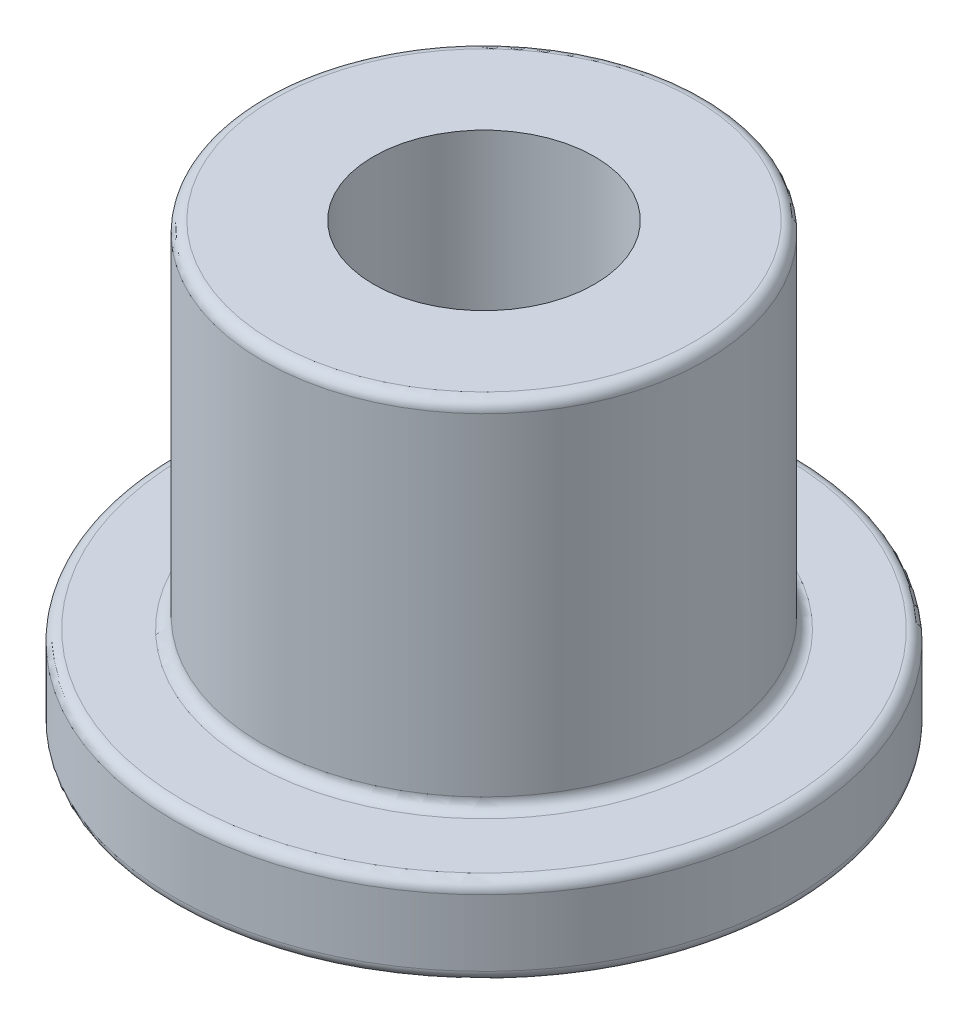
ISO-10303-21;
HEADER;
FILE_DESCRIPTION(('STEP AP214'),'2;1');
FILE_NAME('part.step','',(''),(''),'','','');
FILE_SCHEMA(('AUTOMOTIVE_DESIGN { 1 0 10303 214 1 1 1 1 }'));
ENDSEC;
DATA;
#1=APPLICATION_CONTEXT('core data for automotive mechanical design processes');
#2=APPLICATION_PROTOCOL_DEFINITION('international standard','automotive_design',2000,#1);
#3=PRODUCT_CONTEXT('',#1,'mechanical');
#4=PRODUCT('Part','Part','',(#3));
#5=PRODUCT_RELATED_PRODUCT_CATEGORY('part','',(#4));
#6=PRODUCT_DEFINITION_FORMATION('','',#4);
#7=PRODUCT_DEFINITION_CONTEXT('part definition',#1,'design');
#8=PRODUCT_DEFINITION('design','',#6,#7);
#9=PRODUCT_DEFINITION_SHAPE('','',#8);
#10=(LENGTH_UNIT() NAMED_UNIT(*) SI_UNIT(.MILLI.,.METRE.));
#11=(NAMED_UNIT(*) PLANE_ANGLE_UNIT() SI_UNIT($,.RADIAN.));
#12=(NAMED_UNIT(*) SI_UNIT($,.STERADIAN.) SOLID_ANGLE_UNIT());
#13=UNCERTAINTY_MEASURE_WITH_UNIT(LENGTH_MEASURE(1.E-05),#10,'distance_accuracy_value','');
#14=(GEOMETRIC_REPRESENTATION_CONTEXT(3) GLOBAL_UNCERTAINTY_ASSIGNED_CONTEXT((#13)) GLOBAL_UNIT_ASSIGNED_CONTEXT((#10,
#11,#12)) REPRESENTATION_CONTEXT('',''));
#15=CARTESIAN_POINT('',(0.,0.,0.));
#16=DIRECTION('',(0.,0.,1.));
#17=DIRECTION('',(1.,0.,0.));
#18=AXIS2_PLACEMENT_3D('',#15,#16,#17);
#19=CARTESIAN_POINT('',(0.,2.,0.));
#20=DIRECTION('',(0.,-1.,0.));
#21=DIRECTION('',(0.,0.,-1.));
#22=AXIS2_PLACEMENT_3D('',#19,#20,#21);
#23=CYLINDRICAL_SURFACE('',#22,7.);
#24=CARTESIAN_POINT('',(0.,1.75,0.));
#25=DIRECTION('',(0.,1.,0.));
#26=DIRECTION('',(0.,0.,1.));
#27=AXIS2_PLACEMENT_3D('',#24,#25,#26);
#28=CIRCLE('',#27,7.);
#29=CARTESIAN_POINT('',(0.,1.75,7.));
#30=VERTEX_POINT('',#29);
#31=EDGE_CURVE('E41',#30,#30,#28,.F.);
#32=ORIENTED_EDGE('',*,*,#31,.T.);
#33=EDGE_LOOP('',(#32));
#34=FACE_BOUND('',#33,.T.);
#35=CARTESIAN_POINT('',(0.,0.25,0.));
#36=DIRECTION('',(0.,1.,0.));
#37=DIRECTION('',(0.,0.,1.));
#38=AXIS2_PLACEMENT_3D('',#35,#36,#37);
#39=CIRCLE('',#38,7.);
#40=CARTESIAN_POINT('',(0.,0.25,7.));
#41=VERTEX_POINT('',#40);
#42=EDGE_CURVE('E45',#41,#41,#39,.T.);
#43=ORIENTED_EDGE('',*,*,#42,.T.);
#44=EDGE_LOOP('',(#43));
#45=FACE_BOUND('',#44,.T.);
#46=ADVANCED_FACE('F34',(#34,#45),#23,.T.);
#47=CARTESIAN_POINT('',(0.,2.,0.));
#48=DIRECTION('',(0.,1.,0.));
#49=DIRECTION('',(0.,0.,1.));
#50=AXIS2_PLACEMENT_3D('',#47,#48,#49);
#51=PLANE('',#50);
#52=CARTESIAN_POINT('',(0.,2.,0.));
#53=DIRECTION('',(0.,1.,0.));
#54=DIRECTION('',(0.,0.,1.));
#55=AXIS2_PLACEMENT_3D('',#52,#53,#54);
#56=CIRCLE('',#55,5.25);
#57=CARTESIAN_POINT('',(0.,2.,5.25));
#58=VERTEX_POINT('',#57);
#59=EDGE_CURVE('E49',#58,#58,#56,.F.);
#60=ORIENTED_EDGE('',*,*,#59,.T.);
#61=EDGE_LOOP('',(#60));
#62=FACE_BOUND('',#61,.T.);
#63=CARTESIAN_POINT('',(0.,2.,0.));
#64=DIRECTION('',(0.,1.,0.));
#65=DIRECTION('',(0.,0.,1.));
#66=AXIS2_PLACEMENT_3D('',#63,#64,#65);
#67=CIRCLE('',#66,6.75);
#68=CARTESIAN_POINT('',(0.,2.,6.75));
#69=VERTEX_POINT('',#68);
#70=EDGE_CURVE('E54',#69,#69,#67,.T.);
#71=ORIENTED_EDGE('',*,*,#70,.T.);
#72=EDGE_LOOP('',(#71));
#73=FACE_BOUND('',#72,.T.);
#74=ADVANCED_FACE('F91',(#62,#73),#51,.T.);
#75=CARTESIAN_POINT('',(0.,0.,0.));
#76=DIRECTION('',(0.,1.,0.));
#77=DIRECTION('',(0.,0.,1.));
#78=AXIS2_PLACEMENT_3D('',#75,#76,#77);
#79=PLANE('',#78);
#80=CARTESIAN_POINT('',(0.,0.,0.));
#81=DIRECTION('',(0.,1.,0.));
#82=DIRECTION('',(0.,0.,1.));
#83=AXIS2_PLACEMENT_3D('',#80,#81,#82);
#84=CIRCLE('',#83,6.75);
#85=CARTESIAN_POINT('',(0.,0.,6.75));
#86=VERTEX_POINT('',#85);
#87=EDGE_CURVE('E10',#86,#86,#84,.F.);
#88=ORIENTED_EDGE('',*,*,#87,.T.);
#89=EDGE_LOOP('',(#88));
#90=FACE_BOUND('',#89,.T.);
#91=CARTESIAN_POINT('',(0.,0.,0.));
#92=DIRECTION('',(0.,1.,0.));
#93=DIRECTION('',(0.,0.,1.));
#94=AXIS2_PLACEMENT_3D('',#91,#92,#93);
#95=CIRCLE('',#94,2.5);
#96=CARTESIAN_POINT('',(0.,0.,2.5));
#97=VERTEX_POINT('',#96);
#98=EDGE_CURVE('E66',#97,#97,#95,.T.);
#99=ORIENTED_EDGE('',*,*,#98,.T.);
#100=EDGE_LOOP('',(#99));
#101=FACE_BOUND('',#100,.T.);
#102=ADVANCED_FACE('F87',(#90,#101),#79,.F.);
#103=CARTESIAN_POINT('',(0.,10.,0.));
#104=DIRECTION('',(0.,-1.,0.));
#105=DIRECTION('',(0.,0.,-1.));
#106=AXIS2_PLACEMENT_3D('',#103,#104,#105);
#107=CYLINDRICAL_SURFACE('',#106,5.);
#108=CARTESIAN_POINT('',(0.,9.75,0.));
#109=DIRECTION('',(0.,1.,0.));
#110=DIRECTION('',(0.,0.,1.));
#111=AXIS2_PLACEMENT_3D('',#108,#109,#110);
#112=CIRCLE('',#111,5.);
#113=CARTESIAN_POINT('',(0.,9.75,5.));
#114=VERTEX_POINT('',#113);
#115=EDGE_CURVE('E57',#114,#114,#112,.F.);
#116=ORIENTED_EDGE('',*,*,#115,.T.);
#117=EDGE_LOOP('',(#116));
#118=FACE_BOUND('',#117,.T.);
#119=CARTESIAN_POINT('',(0.,2.25,0.));
#120=DIRECTION('',(0.,1.,0.));
#121=DIRECTION('',(0.,0.,1.));
#122=AXIS2_PLACEMENT_3D('',#119,#120,#121);
#123=CIRCLE('',#122,5.);
#124=CARTESIAN_POINT('',(0.,2.25,5.));
#125=VERTEX_POINT('',#124);
#126=EDGE_CURVE('E60',#125,#125,#123,.T.);
#127=ORIENTED_EDGE('',*,*,#126,.T.);
#128=EDGE_LOOP('',(#127));
#129=FACE_BOUND('',#128,.T.);
#130=ADVANCED_FACE('F78',(#118,#129),#107,.T.);
#131=CARTESIAN_POINT('',(0.,10.,0.));
#132=DIRECTION('',(0.,1.,0.));
#133=DIRECTION('',(0.,0.,1.));
#134=AXIS2_PLACEMENT_3D('',#131,#132,#133);
#135=PLANE('',#134);
#136=CARTESIAN_POINT('',(0.,10.,0.));
#137=DIRECTION('',(0.,1.,0.));
#138=DIRECTION('',(0.,0.,1.));
#139=AXIS2_PLACEMENT_3D('',#136,#137,#138);
#140=CIRCLE('',#139,4.75);
#141=CARTESIAN_POINT('',(0.,10.,4.75));
#142=VERTEX_POINT('',#141);
#143=EDGE_CURVE('E63',#142,#142,#140,.T.);
#144=ORIENTED_EDGE('',*,*,#143,.T.);
#145=EDGE_LOOP('',(#144));
#146=FACE_BOUND('',#145,.T.);
#147=CARTESIAN_POINT('',(0.,10.,0.));
#148=DIRECTION('',(0.,1.,0.));
#149=DIRECTION('',(0.,0.,1.));
#150=AXIS2_PLACEMENT_3D('',#147,#148,#149);
#151=CIRCLE('',#150,2.5);
#152=CARTESIAN_POINT('',(0.,10.,2.5));
#153=VERTEX_POINT('',#152);
#154=EDGE_CURVE('E69',#153,#153,#151,.T.);
#155=ORIENTED_EDGE('',*,*,#154,.F.);
#156=EDGE_LOOP('',(#155));
#157=FACE_BOUND('',#156,.T.);
#158=ADVANCED_FACE('F76',(#146,#157),#135,.T.);
#159=CARTESIAN_POINT('',(0.,-8.,0.));
#160=DIRECTION('',(0.,1.,0.));
#161=DIRECTION('',(0.,0.,1.));
#162=AXIS2_PLACEMENT_3D('',#159,#160,#161);
#163=CYLINDRICAL_SURFACE('',#162,2.5);
#164=ORIENTED_EDGE('',*,*,#154,.T.);
#165=EDGE_LOOP('',(#164));
#166=FACE_BOUND('',#165,.T.);
#167=ORIENTED_EDGE('',*,*,#98,.F.);
#168=EDGE_LOOP('',(#167));
#169=FACE_BOUND('',#168,.T.);
#170=ADVANCED_FACE('F73',(#166,#169),#163,.F.);
#171=CARTESIAN_POINT('',(0.,9.75,0.));
#172=DIRECTION('',(0.,1.,0.));
#173=DIRECTION('',(0.,0.,1.));
#174=AXIS2_PLACEMENT_3D('',#171,#172,#173);
#175=TOROIDAL_SURFACE('',#174,4.75,0.25);
#176=ORIENTED_EDGE('',*,*,#115,.F.);
#177=EDGE_LOOP('',(#176));
#178=FACE_BOUND('',#177,.T.);
#179=ORIENTED_EDGE('',*,*,#143,.F.);
#180=EDGE_LOOP('',(#179));
#181=FACE_BOUND('',#180,.T.);
#182=ADVANCED_FACE('F85',(#178,#181),#175,.T.);
#183=CARTESIAN_POINT('',(0.,2.25,0.));
#184=DIRECTION('',(0.,1.,0.));
#185=DIRECTION('',(0.,0.,1.));
#186=AXIS2_PLACEMENT_3D('',#183,#184,#185);
#187=TOROIDAL_SURFACE('',#186,5.25,0.25);
#188=ORIENTED_EDGE('',*,*,#59,.F.);
#189=EDGE_LOOP('',(#188));
#190=FACE_BOUND('',#189,.T.);
#191=ORIENTED_EDGE('',*,*,#126,.F.);
#192=EDGE_LOOP('',(#191));
#193=FACE_BOUND('',#192,.T.);
#194=ADVANCED_FACE('F103',(#190,#193),#187,.F.);
#195=CARTESIAN_POINT('',(0.,1.75,0.));
#196=DIRECTION('',(0.,1.,0.));
#197=DIRECTION('',(0.,0.,1.));
#198=AXIS2_PLACEMENT_3D('',#195,#196,#197);
#199=TOROIDAL_SURFACE('',#198,6.75,0.25);
#200=ORIENTED_EDGE('',*,*,#31,.F.);
#201=EDGE_LOOP('',(#200));
#202=FACE_BOUND('',#201,.T.);
#203=ORIENTED_EDGE('',*,*,#70,.F.);
#204=EDGE_LOOP('',(#203));
#205=FACE_BOUND('',#204,.T.);
#206=ADVANCED_FACE('F106',(#202,#205),#199,.T.);
#207=CARTESIAN_POINT('',(0.,0.25,0.));
#208=DIRECTION('',(0.,1.,0.));
#209=DIRECTION('',(0.,0.,1.));
#210=AXIS2_PLACEMENT_3D('',#207,#208,#209);
#211=TOROIDAL_SURFACE('',#210,6.75,0.25);
#212=ORIENTED_EDGE('',*,*,#87,.F.);
#213=EDGE_LOOP('',(#212));
#214=FACE_BOUND('',#213,.T.);
#215=ORIENTED_EDGE('',*,*,#42,.F.);
#216=EDGE_LOOP('',(#215));
#217=FACE_BOUND('',#216,.T.);
#218=ADVANCED_FACE('F36',(#214,#217),#211,.T.);
#219=CLOSED_SHELL('',(#46,#74,#102,#130,#158,#170,#182,#194,#206,#218));
#220=MANIFOLD_SOLID_BREP('B2',#219);
#221=ADVANCED_BREP_SHAPE_REPRESENTATION('',(#18,#220),#14);
#222=SHAPE_DEFINITION_REPRESENTATION(#9,#221);
ENDSEC;
END-ISO-10303-21;
